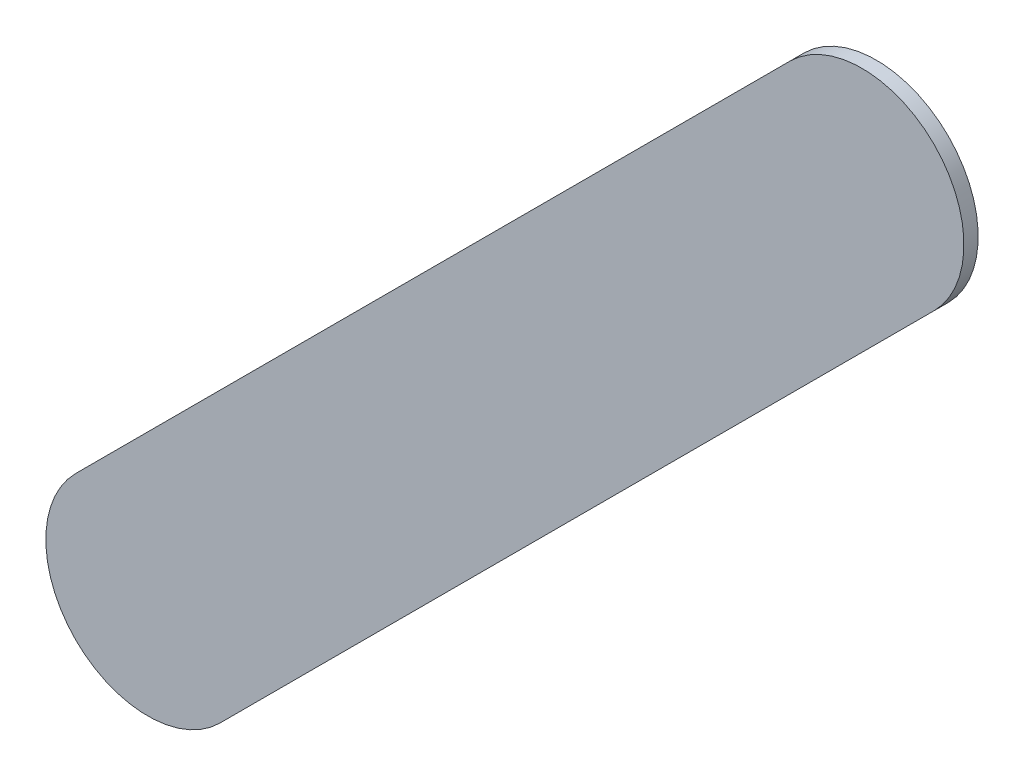
ISO-10303-21;
HEADER;
FILE_DESCRIPTION(('STEP AP214'),'2;1');
FILE_NAME('part.step','',(''),(''),'','','');
FILE_SCHEMA(('AUTOMOTIVE_DESIGN { 1 0 10303 214 1 1 1 1 }'));
ENDSEC;
DATA;
#1=APPLICATION_CONTEXT('core data for automotive mechanical design processes');
#2=APPLICATION_PROTOCOL_DEFINITION('international standard','automotive_design',2000,#1);
#3=PRODUCT_CONTEXT('',#1,'mechanical');
#4=PRODUCT('Part','Part','',(#3));
#5=PRODUCT_RELATED_PRODUCT_CATEGORY('part','',(#4));
#6=PRODUCT_DEFINITION_FORMATION('','',#4);
#7=PRODUCT_DEFINITION_CONTEXT('part definition',#1,'design');
#8=PRODUCT_DEFINITION('design','',#6,#7);
#9=PRODUCT_DEFINITION_SHAPE('','',#8);
#10=(LENGTH_UNIT() NAMED_UNIT(*) SI_UNIT(.MILLI.,.METRE.));
#11=(NAMED_UNIT(*) PLANE_ANGLE_UNIT() SI_UNIT($,.RADIAN.));
#12=(NAMED_UNIT(*) SI_UNIT($,.STERADIAN.) SOLID_ANGLE_UNIT());
#13=UNCERTAINTY_MEASURE_WITH_UNIT(LENGTH_MEASURE(1.E-05),#10,'distance_accuracy_value','');
#14=(GEOMETRIC_REPRESENTATION_CONTEXT(3) GLOBAL_UNCERTAINTY_ASSIGNED_CONTEXT((#13)) GLOBAL_UNIT_ASSIGNED_CONTEXT((#10,
#11,#12)) REPRESENTATION_CONTEXT('',''));
#15=CARTESIAN_POINT('',(0.,0.,0.));
#16=DIRECTION('',(0.,0.,1.));
#17=DIRECTION('',(1.,0.,0.));
#18=AXIS2_PLACEMENT_3D('',#15,#16,#17);
#19=CARTESIAN_POINT('',(132.028776,-110.132776,0.));
#20=DIRECTION('',(0.,0.,1.));
#21=DIRECTION('',(1.,0.,0.));
#22=AXIS2_PLACEMENT_3D('',#19,#20,#21);
#23=PLANE('',#22);
#24=DIRECTION('',(0.707106781186548,0.707106781186548,0.));
#25=VECTOR('',#24,1.);
#26=CARTESIAN_POINT('',(132.028776,-110.132776,0.));
#27=LINE('',#26,#25);
#28=CARTESIAN_POINT('',(132.028776,-110.132776,0.));
#29=VERTEX_POINT('',#28);
#30=CARTESIAN_POINT('',(133.780776,-108.380776,0.));
#31=VERTEX_POINT('',#30);
#32=EDGE_CURVE('E82',#29,#31,#27,.T.);
#33=ORIENTED_EDGE('',*,*,#32,.T.);
#34=CARTESIAN_POINT('',(133.6039995,-108.2039995,0.));
#35=DIRECTION('',(0.,0.,1.));
#36=DIRECTION('',(0.707106781187048,-0.707106781186048,0.));
#37=AXIS2_PLACEMENT_3D('',#34,#35,#36);
#38=CIRCLE('',#37,0.249999723809);
#39=CARTESIAN_POINT('',(133.427223,-108.027223,0.));
#40=VERTEX_POINT('',#39);
#41=EDGE_CURVE('E105',#31,#40,#38,.T.);
#42=ORIENTED_EDGE('',*,*,#41,.T.);
#43=DIRECTION('',(-0.707106781186548,-0.707106781186548,0.));
#44=VECTOR('',#43,1.);
#45=CARTESIAN_POINT('',(133.427223,-108.027223,0.));
#46=LINE('',#45,#44);
#47=CARTESIAN_POINT('',(131.675223,-109.779223,0.));
#48=VERTEX_POINT('',#47);
#49=EDGE_CURVE('E74',#40,#48,#46,.T.);
#50=ORIENTED_EDGE('',*,*,#49,.T.);
#51=CARTESIAN_POINT('',(131.8519995,-109.9559995,0.));
#52=DIRECTION('',(0.,0.,1.));
#53=DIRECTION('',(-0.707106781186548,0.707106781186548,0.));
#54=AXIS2_PLACEMENT_3D('',#51,#52,#53);
#55=CIRCLE('',#54,0.249999723809);
#56=EDGE_CURVE('E11',#48,#29,#55,.T.);
#57=ORIENTED_EDGE('',*,*,#56,.T.);
#58=EDGE_LOOP('',(#33,#42,#50,#57));
#59=FACE_BOUND('',#58,.T.);
#60=ADVANCED_FACE('F17',(#59),#23,.T.);
#61=CARTESIAN_POINT('',(132.028776,-110.132776,-0.035));
#62=DIRECTION('',(0.,0.,1.));
#63=DIRECTION('',(1.,0.,0.));
#64=AXIS2_PLACEMENT_3D('',#61,#62,#63);
#65=PLANE('',#64);
#66=CARTESIAN_POINT('',(131.8519995,-109.9559995,-0.035));
#67=DIRECTION('',(0.,0.,1.));
#68=DIRECTION('',(-0.707106781186548,0.707106781186548,0.));
#69=AXIS2_PLACEMENT_3D('',#66,#67,#68);
#70=CIRCLE('',#69,0.249999723809);
#71=CARTESIAN_POINT('',(131.675223,-109.779223,-0.035));
#72=VERTEX_POINT('',#71);
#73=CARTESIAN_POINT('',(132.028776,-110.132776,-0.035));
#74=VERTEX_POINT('',#73);
#75=EDGE_CURVE('E26',#72,#74,#70,.T.);
#76=ORIENTED_EDGE('',*,*,#75,.F.);
#77=DIRECTION('',(-0.707106781186548,-0.707106781186548,0.));
#78=VECTOR('',#77,1.);
#79=CARTESIAN_POINT('',(133.427223,-108.027223,-0.035));
#80=LINE('',#79,#78);
#81=CARTESIAN_POINT('',(133.427223,-108.027223,-0.035));
#82=VERTEX_POINT('',#81);
#83=EDGE_CURVE('E102',#82,#72,#80,.T.);
#84=ORIENTED_EDGE('',*,*,#83,.F.);
#85=CARTESIAN_POINT('',(133.6039995,-108.2039995,-0.035));
#86=DIRECTION('',(0.,0.,1.));
#87=DIRECTION('',(0.707106781187048,-0.707106781186048,0.));
#88=AXIS2_PLACEMENT_3D('',#85,#86,#87);
#89=CIRCLE('',#88,0.249999723809);
#90=CARTESIAN_POINT('',(133.780776,-108.380776,-0.035));
#91=VERTEX_POINT('',#90);
#92=EDGE_CURVE('E84',#91,#82,#89,.T.);
#93=ORIENTED_EDGE('',*,*,#92,.F.);
#94=DIRECTION('',(0.707106781186548,0.707106781186548,0.));
#95=VECTOR('',#94,1.);
#96=CARTESIAN_POINT('',(132.028776,-110.132776,-0.035));
#97=LINE('',#96,#95);
#98=EDGE_CURVE('E80',#74,#91,#97,.T.);
#99=ORIENTED_EDGE('',*,*,#98,.F.);
#100=EDGE_LOOP('',(#76,#84,#93,#99));
#101=FACE_BOUND('',#100,.T.);
#102=ADVANCED_FACE('F86',(#101),#65,.F.);
#103=CARTESIAN_POINT('',(131.8519995,-109.9559995,-0.035));
#104=DIRECTION('',(0.,0.,-1.));
#105=DIRECTION('',(-0.707106781186548,0.707106781186548,0.));
#106=AXIS2_PLACEMENT_3D('',#103,#104,#105);
#107=CYLINDRICAL_SURFACE('',#106,0.249999723809);
#108=ORIENTED_EDGE('',*,*,#75,.T.);
#109=DIRECTION('',(0.,0.,1.));
#110=VECTOR('',#109,1.);
#111=CARTESIAN_POINT('',(132.028776,-110.132776,-0.035));
#112=LINE('',#111,#110);
#113=EDGE_CURVE('E68',#74,#29,#112,.T.);
#114=ORIENTED_EDGE('',*,*,#113,.T.);
#115=ORIENTED_EDGE('',*,*,#56,.F.);
#116=DIRECTION('',(0.,0.,1.));
#117=VECTOR('',#116,1.);
#118=CARTESIAN_POINT('',(131.675223,-109.779223,-0.035));
#119=LINE('',#118,#117);
#120=EDGE_CURVE('E71',#72,#48,#119,.T.);
#121=ORIENTED_EDGE('',*,*,#120,.F.);
#122=EDGE_LOOP('',(#108,#114,#115,#121));
#123=FACE_BOUND('',#122,.T.);
#124=ADVANCED_FACE('F19',(#123),#107,.T.);
#125=CARTESIAN_POINT('',(133.427223,-108.027223,-0.035));
#126=DIRECTION('',(0.707106781186548,-0.707106781186548,0.));
#127=DIRECTION('',(0.,0.,-1.));
#128=AXIS2_PLACEMENT_3D('',#125,#126,#127);
#129=PLANE('',#128);
#130=ORIENTED_EDGE('',*,*,#83,.T.);
#131=ORIENTED_EDGE('',*,*,#120,.T.);
#132=ORIENTED_EDGE('',*,*,#49,.F.);
#133=DIRECTION('',(0.,0.,1.));
#134=VECTOR('',#133,1.);
#135=CARTESIAN_POINT('',(133.427223,-108.027223,-0.035));
#136=LINE('',#135,#134);
#137=EDGE_CURVE('E107',#82,#40,#136,.T.);
#138=ORIENTED_EDGE('',*,*,#137,.F.);
#139=EDGE_LOOP('',(#130,#131,#132,#138));
#140=FACE_BOUND('',#139,.T.);
#141=ADVANCED_FACE('F118',(#140),#129,.F.);
#142=CARTESIAN_POINT('',(133.6039995,-108.2039995,-0.035));
#143=DIRECTION('',(0.,0.,-1.));
#144=DIRECTION('',(0.707106781187048,-0.707106781186048,0.));
#145=AXIS2_PLACEMENT_3D('',#142,#143,#144);
#146=CYLINDRICAL_SURFACE('',#145,0.249999723809);
#147=ORIENTED_EDGE('',*,*,#92,.T.);
#148=ORIENTED_EDGE('',*,*,#137,.T.);
#149=ORIENTED_EDGE('',*,*,#41,.F.);
#150=DIRECTION('',(0.,0.,1.));
#151=VECTOR('',#150,1.);
#152=CARTESIAN_POINT('',(133.780776,-108.380776,-0.035));
#153=LINE('',#152,#151);
#154=EDGE_CURVE('E90',#91,#31,#153,.T.);
#155=ORIENTED_EDGE('',*,*,#154,.F.);
#156=EDGE_LOOP('',(#147,#148,#149,#155));
#157=FACE_BOUND('',#156,.T.);
#158=ADVANCED_FACE('F121',(#157),#146,.T.);
#159=CARTESIAN_POINT('',(132.028776,-110.132776,-0.035));
#160=DIRECTION('',(-0.707106781186548,0.707106781186548,0.));
#161=DIRECTION('',(0.,0.,1.));
#162=AXIS2_PLACEMENT_3D('',#159,#160,#161);
#163=PLANE('',#162);
#164=ORIENTED_EDGE('',*,*,#98,.T.);
#165=ORIENTED_EDGE('',*,*,#154,.T.);
#166=ORIENTED_EDGE('',*,*,#32,.F.);
#167=ORIENTED_EDGE('',*,*,#113,.F.);
#168=EDGE_LOOP('',(#164,#165,#166,#167));
#169=FACE_BOUND('',#168,.T.);
#170=ADVANCED_FACE('F78',(#169),#163,.F.);
#171=CLOSED_SHELL('',(#60,#102,#124,#141,#158,#170));
#172=MANIFOLD_SOLID_BREP('B1',#171);
#173=ADVANCED_BREP_SHAPE_REPRESENTATION('',(#18,#172),#14);
#174=SHAPE_DEFINITION_REPRESENTATION(#9,#173);
ENDSEC;
END-ISO-10303-21;
